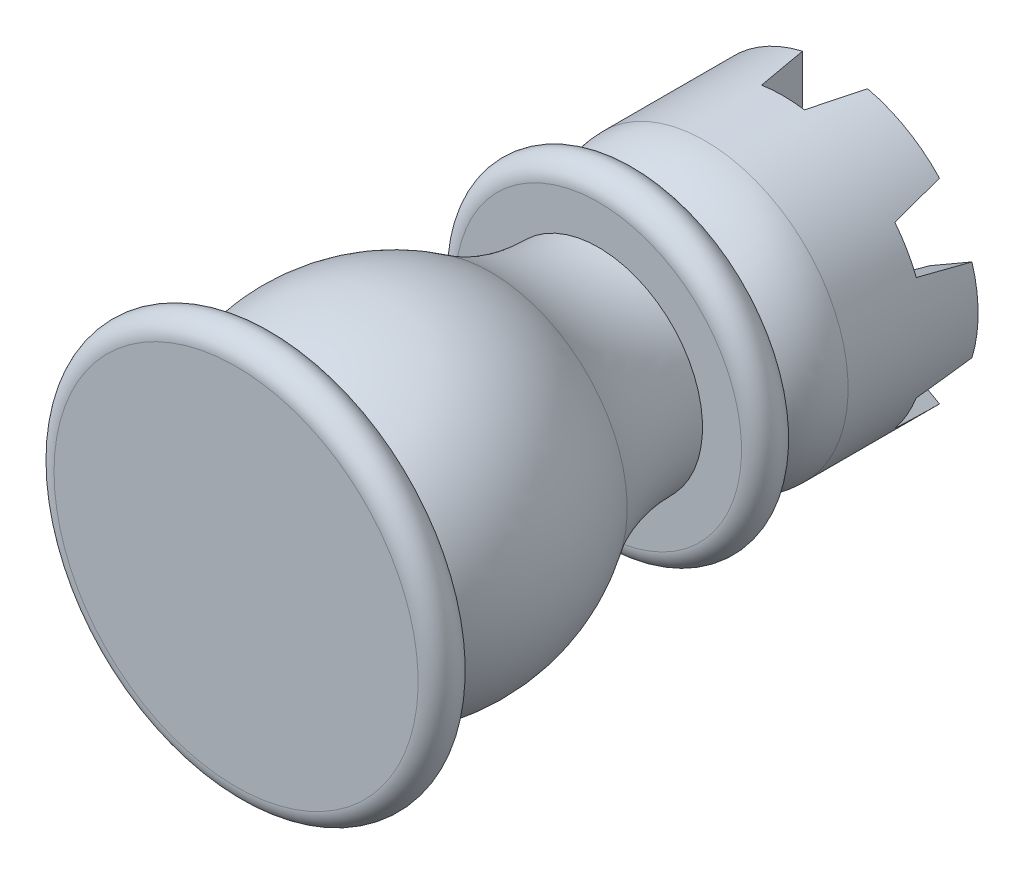
ISO-10303-21;
HEADER;
FILE_DESCRIPTION(('STEP AP214'),'2;1');
FILE_NAME('part.step','',(''),(''),'','','');
FILE_SCHEMA(('AUTOMOTIVE_DESIGN { 1 0 10303 214 1 1 1 1 }'));
ENDSEC;
DATA;
#1=APPLICATION_CONTEXT('core data for automotive mechanical design processes');
#2=APPLICATION_PROTOCOL_DEFINITION('international standard','automotive_design',2000,#1);
#3=PRODUCT_CONTEXT('',#1,'mechanical');
#4=PRODUCT('Part','Part','',(#3));
#5=PRODUCT_RELATED_PRODUCT_CATEGORY('part','',(#4));
#6=PRODUCT_DEFINITION_FORMATION('','',#4);
#7=PRODUCT_DEFINITION_CONTEXT('part definition',#1,'design');
#8=PRODUCT_DEFINITION('design','',#6,#7);
#9=PRODUCT_DEFINITION_SHAPE('','',#8);
#10=(LENGTH_UNIT() NAMED_UNIT(*) SI_UNIT(.MILLI.,.METRE.));
#11=(NAMED_UNIT(*) PLANE_ANGLE_UNIT() SI_UNIT($,.RADIAN.));
#12=(NAMED_UNIT(*) SI_UNIT($,.STERADIAN.) SOLID_ANGLE_UNIT());
#13=UNCERTAINTY_MEASURE_WITH_UNIT(LENGTH_MEASURE(1.E-05),#10,'distance_accuracy_value','');
#14=(GEOMETRIC_REPRESENTATION_CONTEXT(3) GLOBAL_UNCERTAINTY_ASSIGNED_CONTEXT((#13)) GLOBAL_UNIT_ASSIGNED_CONTEXT((#10,
#11,#12)) REPRESENTATION_CONTEXT('',''));
#15=CARTESIAN_POINT('',(0.,0.,0.));
#16=DIRECTION('',(0.,0.,1.));
#17=DIRECTION('',(1.,0.,0.));
#18=AXIS2_PLACEMENT_3D('',#15,#16,#17);
#19=CARTESIAN_POINT('',(-1.64977375331991,-15.5,-40.5708383503721));
#20=DIRECTION('',(0.,0.,1.));
#21=DIRECTION('',(1.,0.,0.));
#22=AXIS2_PLACEMENT_3D('',#19,#20,#21);
#23=PLANE('',#22);
#24=CARTESIAN_POINT('',(0.,0.,-40.5708383503721));
#25=DIRECTION('',(0.,0.,1.));
#26=DIRECTION('',(1.,0.,0.));
#27=AXIS2_PLACEMENT_3D('',#24,#25,#26);
#28=CIRCLE('',#27,6.70530792283383);
#29=CARTESIAN_POINT('',(6.45334587332645,-1.82084633597637,-40.5708383503721));
#30=VERTEX_POINT('',#29);
#31=CARTESIAN_POINT('',(4.8035721200065,-4.67833829772003,-40.5708383503721));
#32=VERTEX_POINT('',#31);
#33=EDGE_CURVE('E473',#30,#32,#28,.F.);
#34=ORIENTED_EDGE('',*,*,#33,.F.);
#35=DIRECTION('',(0.866025403784436,-0.500000000000004,0.));
#36=VECTOR('',#35,1.);
#37=CARTESIAN_POINT('',(-17.5118100026694,12.0154428602013,-40.5708383503721));
#38=LINE('',#37,#36);
#39=CARTESIAN_POINT('',(10.2434156854571,-4.0090441622575,-40.5708383503721));
#40=VERTEX_POINT('',#39);
#41=EDGE_CURVE('E265',#30,#40,#38,.T.);
#42=ORIENTED_EDGE('',*,*,#41,.T.);
#43=CARTESIAN_POINT('',(0.,0.,-40.5708383503721));
#44=DIRECTION('',(0.,0.,1.));
#45=DIRECTION('',(1.,0.,0.));
#46=AXIS2_PLACEMENT_3D('',#43,#44,#45);
#47=CIRCLE('',#46,11.);
#48=CARTESIAN_POINT('',(8.59364193213719,-6.86653612400118,-40.5708383503721));
#49=VERTEX_POINT('',#48);
#50=EDGE_CURVE('E282',#40,#49,#47,.F.);
#51=ORIENTED_EDGE('',*,*,#50,.T.);
#52=DIRECTION('',(0.866025403784436,-0.500000000000004,0.));
#53=VECTOR('',#52,1.);
#54=CARTESIAN_POINT('',(-19.1615837559893,9.15795089845766,-40.5708383503721));
#55=LINE('',#54,#53);
#56=EDGE_CURVE('E260',#32,#49,#55,.T.);
#57=ORIENTED_EDGE('',*,*,#56,.F.);
#58=EDGE_LOOP('',(#34,#42,#51,#57));
#59=FACE_BOUND('',#58,.T.);
#60=ADVANCED_FACE('F47',(#59),#23,.F.);
#61=CARTESIAN_POINT('',(1.64977375331991,-6.49918463369636,-40.5708383503721));
#62=VERTEX_POINT('',#61);
#63=CARTESIAN_POINT('',(-1.64977375331991,-6.4991846336964,-40.5708383503721));
#64=VERTEX_POINT('',#63);
#65=EDGE_CURVE('E505',#62,#64,#28,.F.);
#66=ORIENTED_EDGE('',*,*,#65,.F.);
#67=DIRECTION('',(0.,1.,0.));
#68=VECTOR('',#67,1.);
#69=CARTESIAN_POINT('',(1.64977375331991,-15.5,-40.5708383503721));
#70=LINE('',#69,#68);
#71=CARTESIAN_POINT('',(1.64977375331991,-10.8755802862586,-40.5708383503721));
#72=VERTEX_POINT('',#71);
#73=EDGE_CURVE('E292',#72,#62,#70,.T.);
#74=ORIENTED_EDGE('',*,*,#73,.F.);
#75=CARTESIAN_POINT('',(0.,0.,-40.5708383503721));
#76=DIRECTION('',(0.,0.,1.));
#77=DIRECTION('',(1.,0.,0.));
#78=AXIS2_PLACEMENT_3D('',#75,#76,#77);
#79=CIRCLE('',#78,11.);
#80=CARTESIAN_POINT('',(-1.64977375331991,-10.8755802862586,-40.5708383503721));
#81=VERTEX_POINT('',#80);
#82=EDGE_CURVE('E365',#72,#81,#79,.F.);
#83=ORIENTED_EDGE('',*,*,#82,.T.);
#84=DIRECTION('',(0.,1.,0.));
#85=VECTOR('',#84,1.);
#86=CARTESIAN_POINT('',(-1.64977375331991,-15.5,-40.5708383503721));
#87=LINE('',#86,#85);
#88=EDGE_CURVE('E297',#81,#64,#87,.T.);
#89=ORIENTED_EDGE('',*,*,#88,.T.);
#90=EDGE_LOOP('',(#66,#74,#83,#89));
#91=FACE_BOUND('',#90,.T.);
#92=ADVANCED_FACE('F555',(#91),#23,.F.);
#93=CARTESIAN_POINT('',(-4.8035721200066,-4.67833829771998,-40.5708383503721));
#94=VERTEX_POINT('',#93);
#95=CARTESIAN_POINT('',(-6.4533458733265,-1.82084633597629,-40.5708383503721));
#96=VERTEX_POINT('',#95);
#97=EDGE_CURVE('E62',#94,#96,#28,.F.);
#98=ORIENTED_EDGE('',*,*,#97,.F.);
#99=DIRECTION('',(-0.866025403784443,-0.499999999999992,0.));
#100=VECTOR('',#99,1.);
#101=CARTESIAN_POINT('',(19.1615837559894,9.15795089845737,-40.5708383503721));
#102=LINE('',#101,#100);
#103=CARTESIAN_POINT('',(-8.5936419321373,-6.86653612400107,-40.5708383503721));
#104=VERTEX_POINT('',#103);
#105=EDGE_CURVE('E246',#94,#104,#102,.T.);
#106=ORIENTED_EDGE('',*,*,#105,.T.);
#107=CARTESIAN_POINT('',(-10.2434156854572,-4.00904416225736,-40.5708383503721));
#108=VERTEX_POINT('',#107);
#109=EDGE_CURVE('E283',#104,#108,#47,.F.);
#110=ORIENTED_EDGE('',*,*,#109,.T.);
#111=DIRECTION('',(-0.866025403784443,-0.499999999999992,0.));
#112=VECTOR('',#111,1.);
#113=CARTESIAN_POINT('',(17.5118100026695,12.0154428602011,-40.5708383503721));
#114=LINE('',#113,#112);
#115=EDGE_CURVE('E236',#96,#108,#114,.T.);
#116=ORIENTED_EDGE('',*,*,#115,.F.);
#117=EDGE_LOOP('',(#98,#106,#110,#116));
#118=FACE_BOUND('',#117,.T.);
#119=ADVANCED_FACE('F497',(#118),#23,.F.);
#120=CARTESIAN_POINT('',(-6.45334587332645,1.82084633597636,-40.5708383503721));
#121=VERTEX_POINT('',#120);
#122=CARTESIAN_POINT('',(-4.80357212000653,4.67833829772004,-40.5708383503721));
#123=VERTEX_POINT('',#122);
#124=EDGE_CURVE('E379',#121,#123,#28,.F.);
#125=ORIENTED_EDGE('',*,*,#124,.F.);
#126=CARTESIAN_POINT('',(-10.2434156854571,4.0090441622575,-40.5708383503721));
#127=VERTEX_POINT('',#126);
#128=EDGE_CURVE('E256',#127,#121,#55,.T.);
#129=ORIENTED_EDGE('',*,*,#128,.F.);
#130=CARTESIAN_POINT('',(-8.5936419321372,6.86653612400118,-40.5708383503721));
#131=VERTEX_POINT('',#130);
#132=EDGE_CURVE('E377',#127,#131,#47,.F.);
#133=ORIENTED_EDGE('',*,*,#132,.T.);
#134=EDGE_CURVE('E261',#131,#123,#38,.T.);
#135=ORIENTED_EDGE('',*,*,#134,.T.);
#136=EDGE_LOOP('',(#125,#129,#133,#135));
#137=FACE_BOUND('',#136,.T.);
#138=ADVANCED_FACE('F376',(#137),#23,.F.);
#139=CARTESIAN_POINT('',(-1.64977375331991,6.49918463369639,-40.5708383503721));
#140=VERTEX_POINT('',#139);
#141=CARTESIAN_POINT('',(1.64977375331991,6.49918463369636,-40.5708383503721));
#142=VERTEX_POINT('',#141);
#143=EDGE_CURVE('E456',#140,#142,#28,.F.);
#144=ORIENTED_EDGE('',*,*,#143,.F.);
#145=CARTESIAN_POINT('',(-1.64977375331991,10.8755802862586,-40.5708383503721));
#146=VERTEX_POINT('',#145);
#147=EDGE_CURVE('E291',#140,#146,#87,.T.);
#148=ORIENTED_EDGE('',*,*,#147,.T.);
#149=CARTESIAN_POINT('',(1.64977375331991,10.8755802862586,-40.5708383503721));
#150=VERTEX_POINT('',#149);
#151=EDGE_CURVE('E361',#146,#150,#79,.F.);
#152=ORIENTED_EDGE('',*,*,#151,.T.);
#153=EDGE_CURVE('E296',#142,#150,#70,.T.);
#154=ORIENTED_EDGE('',*,*,#153,.F.);
#155=EDGE_LOOP('',(#144,#148,#152,#154));
#156=FACE_BOUND('',#155,.T.);
#157=ADVANCED_FACE('F453',(#156),#23,.F.);
#158=CARTESIAN_POINT('',(0.,0.,-44.5708383503721));
#159=DIRECTION('',(0.,0.,-1.));
#160=DIRECTION('',(-1.,0.,0.));
#161=AXIS2_PLACEMENT_3D('',#158,#159,#160);
#162=PLANE('',#161);
#163=DIRECTION('',(0.,1.,0.));
#164=VECTOR('',#163,1.);
#165=CARTESIAN_POINT('',(-2.5,0.,-44.5708383503721));
#166=LINE('',#165,#164);
#167=CARTESIAN_POINT('',(-2.5,6.9761900212122,-44.5708383503721));
#168=VERTEX_POINT('',#167);
#169=CARTESIAN_POINT('',(-2.5,10.7121426428143,-44.5708383503721));
#170=VERTEX_POINT('',#169);
#171=EDGE_CURVE('E356',#168,#170,#166,.T.);
#172=ORIENTED_EDGE('',*,*,#171,.F.);
#173=CARTESIAN_POINT('',(0.,0.,-44.5708383503721));
#174=DIRECTION('',(0.,0.,-1.));
#175=DIRECTION('',(-1.,0.,0.));
#176=AXIS2_PLACEMENT_3D('',#173,#174,#175);
#177=CIRCLE('',#176,7.41061584566766);
#178=CARTESIAN_POINT('',(-4.79155777999724,5.65315852006721,-44.5708383503721));
#179=VERTEX_POINT('',#178);
#180=EDGE_CURVE('E514',#168,#179,#177,.F.);
#181=ORIENTED_EDGE('',*,*,#180,.T.);
#182=DIRECTION('',(0.866025403784436,-0.500000000000004,0.));
#183=VECTOR('',#182,1.);
#184=CARTESIAN_POINT('',(-17.0866968793294,12.7517603887906,-44.5708383503721));
#185=LINE('',#184,#183);
#186=CARTESIAN_POINT('',(-8.0269876576397,7.52113483086827,-44.5708383503721));
#187=VERTEX_POINT('',#186);
#188=EDGE_CURVE('E247',#187,#179,#185,.T.);
#189=ORIENTED_EDGE('',*,*,#188,.F.);
#190=CARTESIAN_POINT('',(0.,0.,-44.5708383503721));
#191=DIRECTION('',(0.,0.,-1.));
#192=DIRECTION('',(-1.,0.,0.));
#193=AXIS2_PLACEMENT_3D('',#190,#191,#192);
#194=CIRCLE('',#193,11.);
#195=EDGE_CURVE('E314',#187,#170,#194,.T.);
#196=ORIENTED_EDGE('',*,*,#195,.T.);
#197=EDGE_LOOP('',(#172,#181,#189,#196));
#198=FACE_BOUND('',#197,.T.);
#199=ADVANCED_FACE('F540',(#198),#162,.T.);
#200=DIRECTION('',(0.866025403784436,-0.500000000000004,0.));
#201=VECTOR('',#200,1.);
#202=CARTESIAN_POINT('',(-19.5866968793294,8.42163336986841,-44.5708383503721));
#203=LINE('',#202,#201);
#204=CARTESIAN_POINT('',(-10.5269876576397,3.19100781194609,-44.5708383503721));
#205=VERTEX_POINT('',#204);
#206=CARTESIAN_POINT('',(-7.29155777999726,1.32303150114503,-44.5708383503721));
#207=VERTEX_POINT('',#206);
#208=EDGE_CURVE('E219',#205,#207,#203,.T.);
#209=ORIENTED_EDGE('',*,*,#208,.T.);
#210=CARTESIAN_POINT('',(0.,0.,-44.5708383503721));
#211=DIRECTION('',(0.,0.,-1.));
#212=DIRECTION('',(-1.,0.,0.));
#213=AXIS2_PLACEMENT_3D('',#210,#211,#212);
#214=CIRCLE('',#213,7.41061584566766);
#215=CARTESIAN_POINT('',(-7.2915577799973,-1.32303150114495,-44.5708383503721));
#216=VERTEX_POINT('',#215);
#217=EDGE_CURVE('E208',#207,#216,#214,.F.);
#218=ORIENTED_EDGE('',*,*,#217,.T.);
#219=DIRECTION('',(-0.866025403784443,-0.499999999999992,0.));
#220=VECTOR('',#219,1.);
#221=CARTESIAN_POINT('',(17.0866968793295,12.7517603887903,-44.5708383503721));
#222=LINE('',#221,#220);
#223=CARTESIAN_POINT('',(-10.5269876576398,-3.19100781194595,-44.5708383503721));
#224=VERTEX_POINT('',#223);
#225=EDGE_CURVE('E217',#216,#224,#222,.T.);
#226=ORIENTED_EDGE('',*,*,#225,.T.);
#227=EDGE_CURVE('E313',#224,#205,#194,.T.);
#228=ORIENTED_EDGE('',*,*,#227,.T.);
#229=EDGE_LOOP('',(#209,#218,#226,#228));
#230=FACE_BOUND('',#229,.T.);
#231=ADVANCED_FACE('F215',(#230),#162,.T.);
#232=DIRECTION('',(0.,-1.,0.));
#233=VECTOR('',#232,1.);
#234=CARTESIAN_POINT('',(2.5,0.,-44.5708383503721));
#235=LINE('',#234,#233);
#236=CARTESIAN_POINT('',(2.5,-6.97619002121222,-44.5708383503721));
#237=VERTEX_POINT('',#236);
#238=CARTESIAN_POINT('',(2.5,-10.7121426428143,-44.5708383503721));
#239=VERTEX_POINT('',#238);
#240=EDGE_CURVE('E352',#237,#239,#235,.T.);
#241=ORIENTED_EDGE('',*,*,#240,.F.);
#242=CARTESIAN_POINT('',(0.,0.,-44.5708383503721));
#243=DIRECTION('',(0.,0.,-1.));
#244=DIRECTION('',(-1.,0.,0.));
#245=AXIS2_PLACEMENT_3D('',#242,#243,#244);
#246=CIRCLE('',#245,7.41061584566766);
#247=CARTESIAN_POINT('',(4.79155777999724,-5.65315852006722,-44.5708383503721));
#248=VERTEX_POINT('',#247);
#249=EDGE_CURVE('E524',#237,#248,#246,.F.);
#250=ORIENTED_EDGE('',*,*,#249,.T.);
#251=CARTESIAN_POINT('',(8.0269876576397,-7.52113483086828,-44.5708383503721));
#252=VERTEX_POINT('',#251);
#253=EDGE_CURVE('E255',#248,#252,#203,.T.);
#254=ORIENTED_EDGE('',*,*,#253,.T.);
#255=EDGE_CURVE('E312',#252,#239,#194,.T.);
#256=ORIENTED_EDGE('',*,*,#255,.T.);
#257=EDGE_LOOP('',(#241,#250,#254,#256));
#258=FACE_BOUND('',#257,.T.);
#259=ADVANCED_FACE('F729',(#258),#162,.T.);
#260=CARTESIAN_POINT('',(7.29155777999725,-1.32303150114503,-44.5708383503721));
#261=VERTEX_POINT('',#260);
#262=CARTESIAN_POINT('',(10.5269876576397,-3.19100781194609,-44.5708383503721));
#263=VERTEX_POINT('',#262);
#264=EDGE_CURVE('E252',#261,#263,#185,.T.);
#265=ORIENTED_EDGE('',*,*,#264,.F.);
#266=CARTESIAN_POINT('',(0.,0.,-44.5708383503721));
#267=DIRECTION('',(0.,0.,-1.));
#268=DIRECTION('',(-1.,0.,0.));
#269=AXIS2_PLACEMENT_3D('',#266,#267,#268);
#270=CIRCLE('',#269,7.41061584566766);
#271=CARTESIAN_POINT('',(7.29155777999728,1.32303150114494,-44.5708383503721));
#272=VERTEX_POINT('',#271);
#273=EDGE_CURVE('E489',#261,#272,#270,.F.);
#274=ORIENTED_EDGE('',*,*,#273,.T.);
#275=DIRECTION('',(-0.866025403784443,-0.499999999999992,0.));
#276=VECTOR('',#275,1.);
#277=CARTESIAN_POINT('',(19.5866968793295,8.42163336986812,-44.5708383503721));
#278=LINE('',#277,#276);
#279=CARTESIAN_POINT('',(10.5269876576398,3.19100781194595,-44.5708383503721));
#280=VERTEX_POINT('',#279);
#281=EDGE_CURVE('E239',#280,#272,#278,.T.);
#282=ORIENTED_EDGE('',*,*,#281,.F.);
#283=EDGE_CURVE('E439',#280,#263,#194,.T.);
#284=ORIENTED_EDGE('',*,*,#283,.T.);
#285=EDGE_LOOP('',(#265,#274,#282,#284));
#286=FACE_BOUND('',#285,.T.);
#287=ADVANCED_FACE('F711',(#286),#162,.T.);
#288=CARTESIAN_POINT('',(-1.64977375331991,-15.5,-40.5708383503721));
#289=DIRECTION('',(-0.978147600733806,0.,0.20791169081776));
#290=DIRECTION('',(0.20791169081776,0.,0.978147600733806));
#291=AXIS2_PLACEMENT_3D('',#288,#289,#290);
#292=PLANE('',#291);
#293=CARTESIAN_POINT('',(-14.196649835293,0.,-99.5992493455178));
#294=DIRECTION('',(-0.978147600733806,0.,0.20791169081776));
#295=DIRECTION('',(-0.20791169081776,0.,-0.978147600733805));
#296=AXIS2_PLACEMENT_3D('',#293,#294,#295);
#297=ELLIPSE('',#296,82.3119149400137,9.55671284905579);
#298=EDGE_CURVE('E518',#168,#140,#297,.F.);
#299=ORIENTED_EDGE('',*,*,#298,.F.);
#300=ORIENTED_EDGE('',*,*,#171,.T.);
#301=CARTESIAN_POINT('',(0.,0.,-32.809263076676));
#302=DIRECTION('',(-0.978147600733806,0.,0.20791169081776));
#303=DIRECTION('',(-0.20791169081776,0.,-0.978147600733806));
#304=AXIS2_PLACEMENT_3D('',#301,#302,#303);
#305=ELLIPSE('',#304,52.9070777921854,11.);
#306=EDGE_CURVE('E307',#170,#146,#305,.F.);
#307=ORIENTED_EDGE('',*,*,#306,.T.);
#308=ORIENTED_EDGE('',*,*,#147,.F.);
#309=EDGE_LOOP('',(#299,#300,#307,#308));
#310=FACE_BOUND('',#309,.T.);
#311=ADVANCED_FACE('F460',(#310),#292,.F.);
#312=CARTESIAN_POINT('',(1.64977375331991,-15.5,-40.5708383503721));
#313=DIRECTION('',(0.978147600733806,0.,0.20791169081776));
#314=DIRECTION('',(0.20791169081776,0.,-0.978147600733806));
#315=AXIS2_PLACEMENT_3D('',#312,#313,#314);
#316=PLANE('',#315);
#317=CARTESIAN_POINT('',(14.196649835293,0.,-99.5992493455177));
#318=DIRECTION('',(0.978147600733806,0.,0.20791169081776));
#319=DIRECTION('',(0.20791169081776,0.,-0.978147600733805));
#320=AXIS2_PLACEMENT_3D('',#317,#318,#319);
#321=ELLIPSE('',#320,82.3119149400136,9.55671284905578);
#322=EDGE_CURVE('E513',#237,#62,#321,.F.);
#323=ORIENTED_EDGE('',*,*,#322,.F.);
#324=ORIENTED_EDGE('',*,*,#240,.T.);
#325=CARTESIAN_POINT('',(0.,0.,-32.809263076676));
#326=DIRECTION('',(0.978147600733806,0.,0.20791169081776));
#327=DIRECTION('',(0.20791169081776,0.,-0.978147600733806));
#328=AXIS2_PLACEMENT_3D('',#325,#326,#327);
#329=ELLIPSE('',#328,52.9070777921851,11.);
#330=EDGE_CURVE('E303',#239,#72,#329,.F.);
#331=ORIENTED_EDGE('',*,*,#330,.T.);
#332=ORIENTED_EDGE('',*,*,#73,.T.);
#333=EDGE_LOOP('',(#323,#324,#331,#332));
#334=FACE_BOUND('',#333,.T.);
#335=ADVANCED_FACE('F571',(#334),#316,.F.);
#336=CARTESIAN_POINT('',(-4.79155777999735,-5.65315852006716,-44.5708383503721));
#337=VERTEX_POINT('',#336);
#338=CARTESIAN_POINT('',(-8.02698765763981,-7.52113483086816,-44.5708383503721));
#339=VERTEX_POINT('',#338);
#340=EDGE_CURVE('E234',#337,#339,#278,.T.);
#341=ORIENTED_EDGE('',*,*,#340,.F.);
#342=CARTESIAN_POINT('',(0.,0.,-44.5708383503721));
#343=DIRECTION('',(0.,0.,-1.));
#344=DIRECTION('',(-1.,0.,0.));
#345=AXIS2_PLACEMENT_3D('',#342,#343,#344);
#346=CIRCLE('',#345,7.41061584566766);
#347=CARTESIAN_POINT('',(-2.5,-6.9761900212122,-44.5708383503721));
#348=VERTEX_POINT('',#347);
#349=EDGE_CURVE('E424',#337,#348,#346,.F.);
#350=ORIENTED_EDGE('',*,*,#349,.T.);
#351=CARTESIAN_POINT('',(-2.5,-10.7121426428143,-44.5708383503721));
#352=VERTEX_POINT('',#351);
#353=EDGE_CURVE('E357',#352,#348,#166,.T.);
#354=ORIENTED_EDGE('',*,*,#353,.F.);
#355=EDGE_CURVE('E308',#352,#339,#194,.T.);
#356=ORIENTED_EDGE('',*,*,#355,.T.);
#357=EDGE_LOOP('',(#341,#350,#354,#356));
#358=FACE_BOUND('',#357,.T.);
#359=ADVANCED_FACE('F423',(#358),#162,.T.);
#360=CARTESIAN_POINT('',(0.,0.,1.5));
#361=DIRECTION('',(0.,0.,1.));
#362=DIRECTION('',(1.,0.,0.));
#363=AXIS2_PLACEMENT_3D('',#360,#361,#362);
#364=PLANE('',#363);
#365=CARTESIAN_POINT('',(0.,0.,1.49999999999999));
#366=DIRECTION('',(0.,0.,-1.));
#367=DIRECTION('',(-1.,0.,0.));
#368=AXIS2_PLACEMENT_3D('',#365,#366,#367);
#369=CIRCLE('',#368,14.);
#370=CARTESIAN_POINT('',(-14.,0.,1.5));
#371=VERTEX_POINT('',#370);
#372=EDGE_CURVE('E316',#371,#371,#369,.T.);
#373=ORIENTED_EDGE('',*,*,#372,.F.);
#374=EDGE_LOOP('',(#373));
#375=FACE_BOUND('',#374,.T.);
#376=ADVANCED_FACE('F49',(#375),#364,.T.);
#377=CARTESIAN_POINT('',(0.,0.,-36.5708383503721));
#378=DIRECTION('',(0.,0.,-1.));
#379=DIRECTION('',(-1.,0.,0.));
#380=AXIS2_PLACEMENT_3D('',#377,#378,#379);
#381=CYLINDRICAL_SURFACE('',#380,11.);
#382=CARTESIAN_POINT('',(0.,0.,-32.809263076676));
#383=DIRECTION('',(0.489073800366907,0.847100670886272,0.20791169081776));
#384=DIRECTION('',(0.10395584540888,0.180056805991956,-0.978147600733806));
#385=AXIS2_PLACEMENT_3D('',#382,#383,#384);
#386=ELLIPSE('',#385,52.9070777921852,11.);
#387=EDGE_CURVE('E272',#131,#187,#386,.F.);
#388=ORIENTED_EDGE('',*,*,#387,.F.);
#389=ORIENTED_EDGE('',*,*,#132,.F.);
#390=CARTESIAN_POINT('',(0.,0.,-32.809263076676));
#391=DIRECTION('',(-0.489073800366907,-0.847100670886272,0.20791169081776));
#392=DIRECTION('',(-0.103955845408881,-0.180056805991955,-0.978147600733806));
#393=AXIS2_PLACEMENT_3D('',#390,#391,#392);
#394=ELLIPSE('',#393,52.9070777921854,11.);
#395=EDGE_CURVE('E56',#205,#127,#394,.F.);
#396=ORIENTED_EDGE('',*,*,#395,.F.);
#397=ORIENTED_EDGE('',*,*,#227,.F.);
#398=CARTESIAN_POINT('',(0.,0.,-32.809263076676));
#399=DIRECTION('',(-0.489073800366895,0.847100670886278,0.20791169081776));
#400=DIRECTION('',(-0.103955845408879,0.180056805991956,-0.978147600733805));
#401=AXIS2_PLACEMENT_3D('',#398,#399,#400);
#402=ELLIPSE('',#401,52.9070777921854,11.);
#403=EDGE_CURVE('E225',#108,#224,#402,.F.);
#404=ORIENTED_EDGE('',*,*,#403,.F.);
#405=ORIENTED_EDGE('',*,*,#109,.F.);
#406=CARTESIAN_POINT('',(0.,0.,-32.809263076676));
#407=DIRECTION('',(0.489073800366895,-0.847100670886278,0.20791169081776));
#408=DIRECTION('',(0.103955845408878,-0.180056805991957,-0.978147600733805));
#409=AXIS2_PLACEMENT_3D('',#406,#407,#408);
#410=ELLIPSE('',#409,52.9070777921852,11.);
#411=EDGE_CURVE('E268',#339,#104,#410,.F.);
#412=ORIENTED_EDGE('',*,*,#411,.F.);
#413=ORIENTED_EDGE('',*,*,#355,.F.);
#414=EDGE_CURVE('E304',#81,#352,#305,.F.);
#415=ORIENTED_EDGE('',*,*,#414,.F.);
#416=ORIENTED_EDGE('',*,*,#82,.F.);
#417=ORIENTED_EDGE('',*,*,#330,.F.);
#418=ORIENTED_EDGE('',*,*,#255,.F.);
#419=CARTESIAN_POINT('',(0.,0.,-32.809263076676));
#420=DIRECTION('',(-0.489073800366907,-0.847100670886272,0.20791169081776));
#421=DIRECTION('',(-0.103955845408881,-0.180056805991955,-0.978147600733806));
#422=AXIS2_PLACEMENT_3D('',#419,#420,#421);
#423=ELLIPSE('',#422,52.9070777921854,11.);
#424=EDGE_CURVE('E275',#49,#252,#423,.F.);
#425=ORIENTED_EDGE('',*,*,#424,.F.);
#426=ORIENTED_EDGE('',*,*,#50,.F.);
#427=CARTESIAN_POINT('',(0.,0.,-32.809263076676));
#428=DIRECTION('',(0.489073800366907,0.847100670886272,0.20791169081776));
#429=DIRECTION('',(0.10395584540888,0.180056805991956,-0.978147600733806));
#430=AXIS2_PLACEMENT_3D('',#427,#428,#429);
#431=ELLIPSE('',#430,52.9070777921852,11.);
#432=EDGE_CURVE('E287',#263,#40,#431,.F.);
#433=ORIENTED_EDGE('',*,*,#432,.F.);
#434=ORIENTED_EDGE('',*,*,#283,.F.);
#435=CARTESIAN_POINT('',(0.,0.,-32.809263076676));
#436=DIRECTION('',(0.489073800366895,-0.847100670886278,0.20791169081776));
#437=DIRECTION('',(0.103955845408878,-0.180056805991957,-0.978147600733805));
#438=AXIS2_PLACEMENT_3D('',#435,#436,#437);
#439=ELLIPSE('',#438,52.9070777921852,11.);
#440=CARTESIAN_POINT('',(10.2434156854572,4.00904416225736,-40.5708383503721));
#441=VERTEX_POINT('',#440);
#442=EDGE_CURVE('E284',#441,#280,#439,.F.);
#443=ORIENTED_EDGE('',*,*,#442,.F.);
#444=CARTESIAN_POINT('',(8.59364193213728,6.86653612400106,-40.5708383503721));
#445=VERTEX_POINT('',#444);
#446=EDGE_CURVE('E279',#445,#441,#47,.F.);
#447=ORIENTED_EDGE('',*,*,#446,.F.);
#448=CARTESIAN_POINT('',(0.,0.,-32.809263076676));
#449=DIRECTION('',(-0.489073800366895,0.847100670886278,0.20791169081776));
#450=DIRECTION('',(-0.103955845408879,0.180056805991956,-0.978147600733805));
#451=AXIS2_PLACEMENT_3D('',#448,#449,#450);
#452=ELLIPSE('',#451,52.9070777921854,11.);
#453=CARTESIAN_POINT('',(8.02698765763981,7.52113483086817,-44.5708383503721));
#454=VERTEX_POINT('',#453);
#455=EDGE_CURVE('E251',#454,#445,#452,.F.);
#456=ORIENTED_EDGE('',*,*,#455,.F.);
#457=CARTESIAN_POINT('',(2.5,10.7121426428143,-44.5708383503721));
#458=VERTEX_POINT('',#457);
#459=EDGE_CURVE('E315',#458,#454,#194,.T.);
#460=ORIENTED_EDGE('',*,*,#459,.F.);
#461=EDGE_CURVE('E70',#150,#458,#329,.F.);
#462=ORIENTED_EDGE('',*,*,#461,.F.);
#463=ORIENTED_EDGE('',*,*,#151,.F.);
#464=ORIENTED_EDGE('',*,*,#306,.F.);
#465=ORIENTED_EDGE('',*,*,#195,.F.);
#466=EDGE_LOOP('',(#388,#389,#396,#397,#404,#405,#412,#413,#415,#416,#417,#418,#425,#426,#433,
#434,#443,#447,#456,#460,#462,#463,#464,#465));
#467=FACE_BOUND('',#466,.T.);
#468=CARTESIAN_POINT('',(0.,0.,-34.5708383503721));
#469=DIRECTION('',(0.,0.,-1.));
#470=DIRECTION('',(-1.,0.,0.));
#471=AXIS2_PLACEMENT_3D('',#468,#469,#470);
#472=CIRCLE('',#471,11.);
#473=CARTESIAN_POINT('',(-11.,0.,-34.5708383503721));
#474=VERTEX_POINT('',#473);
#475=EDGE_CURVE('E348',#474,#474,#472,.T.);
#476=ORIENTED_EDGE('',*,*,#475,.T.);
#477=EDGE_LOOP('',(#476));
#478=FACE_BOUND('',#477,.T.);
#479=ADVANCED_FACE('F381',(#467,#478),#381,.T.);
#480=CARTESIAN_POINT('',(0.,0.,-34.5708383503721));
#481=DIRECTION('',(0.,0.,-1.));
#482=DIRECTION('',(-1.,0.,0.));
#483=AXIS2_PLACEMENT_3D('',#480,#481,#482);
#484=DEGENERATE_TOROIDAL_SURFACE('',#483,4.99999999999999,6.,.T.);
#485=CARTESIAN_POINT('',(0.,0.,-29.3746859276655));
#486=DIRECTION('',(0.,0.,-1.));
#487=DIRECTION('',(-1.,0.,0.));
#488=AXIS2_PLACEMENT_3D('',#485,#486,#487);
#489=CIRCLE('',#488,8.00000000000001);
#490=CARTESIAN_POINT('',(-8.00000000000001,0.,-29.3746859276655));
#491=VERTEX_POINT('',#490);
#492=EDGE_CURVE('E344',#491,#491,#489,.T.);
#493=ORIENTED_EDGE('',*,*,#492,.T.);
#494=EDGE_LOOP('',(#493));
#495=FACE_BOUND('',#494,.T.);
#496=ORIENTED_EDGE('',*,*,#475,.F.);
#497=EDGE_LOOP('',(#496));
#498=FACE_BOUND('',#497,.T.);
#499=ADVANCED_FACE('F605',(#495,#498),#484,.T.);
#500=CARTESIAN_POINT('',(0.,0.,-29.3746859276655));
#501=DIRECTION('',(0.,0.,1.));
#502=DIRECTION('',(1.,0.,0.));
#503=AXIS2_PLACEMENT_3D('',#500,#501,#502);
#504=PLANE('',#503);
#505=ORIENTED_EDGE('',*,*,#492,.F.);
#506=EDGE_LOOP('',(#505));
#507=FACE_BOUND('',#506,.T.);
#508=CARTESIAN_POINT('',(0.,0.,-29.3746859276655));
#509=DIRECTION('',(0.,0.,-1.));
#510=DIRECTION('',(-1.,0.,0.));
#511=AXIS2_PLACEMENT_3D('',#508,#509,#510);
#512=CIRCLE('',#511,11.);
#513=CARTESIAN_POINT('',(-11.,0.,-29.3746859276655));
#514=VERTEX_POINT('',#513);
#515=EDGE_CURVE('E340',#514,#514,#512,.T.);
#516=ORIENTED_EDGE('',*,*,#515,.T.);
#517=EDGE_LOOP('',(#516));
#518=FACE_BOUND('',#517,.T.);
#519=ADVANCED_FACE('F674',(#507,#518),#504,.F.);
#520=CARTESIAN_POINT('',(0.,0.,-27.8746859276655));
#521=DIRECTION('',(0.,0.,-1.));
#522=DIRECTION('',(-1.,0.,0.));
#523=AXIS2_PLACEMENT_3D('',#520,#521,#522);
#524=TOROIDAL_SURFACE('',#523,11.,1.49999999999999);
#525=CARTESIAN_POINT('',(0.,0.,-26.3746859276655));
#526=DIRECTION('',(0.,0.,-1.));
#527=DIRECTION('',(-1.,0.,0.));
#528=AXIS2_PLACEMENT_3D('',#525,#526,#527);
#529=CIRCLE('',#528,11.);
#530=CARTESIAN_POINT('',(-11.,0.,-26.3746859276655));
#531=VERTEX_POINT('',#530);
#532=EDGE_CURVE('E336',#531,#531,#529,.T.);
#533=ORIENTED_EDGE('',*,*,#532,.T.);
#534=EDGE_LOOP('',(#533));
#535=FACE_BOUND('',#534,.T.);
#536=ORIENTED_EDGE('',*,*,#515,.F.);
#537=EDGE_LOOP('',(#536));
#538=FACE_BOUND('',#537,.T.);
#539=ADVANCED_FACE('F663',(#535,#538),#524,.T.);
#540=CARTESIAN_POINT('',(0.,0.,-26.3746859276655));
#541=DIRECTION('',(0.,0.,1.));
#542=DIRECTION('',(1.,0.,0.));
#543=AXIS2_PLACEMENT_3D('',#540,#541,#542);
#544=PLANE('',#543);
#545=CARTESIAN_POINT('',(0.,0.,-26.3746859276655));
#546=DIRECTION('',(0.,0.,-1.));
#547=DIRECTION('',(-1.,0.,0.));
#548=AXIS2_PLACEMENT_3D('',#545,#546,#547);
#549=CIRCLE('',#548,8.00000000000001);
#550=CARTESIAN_POINT('',(-8.00000000000001,0.,-26.3746859276655));
#551=VERTEX_POINT('',#550);
#552=EDGE_CURVE('E332',#551,#551,#549,.T.);
#553=ORIENTED_EDGE('',*,*,#552,.T.);
#554=EDGE_LOOP('',(#553));
#555=FACE_BOUND('',#554,.T.);
#556=ORIENTED_EDGE('',*,*,#532,.F.);
#557=EDGE_LOOP('',(#556));
#558=FACE_BOUND('',#557,.T.);
#559=ADVANCED_FACE('F652',(#555,#558),#544,.T.);
#560=CARTESIAN_POINT('',(0.,0.,-26.3746859276655));
#561=DIRECTION('',(0.,0.,-1.));
#562=DIRECTION('',(-1.,0.,0.));
#563=AXIS2_PLACEMENT_3D('',#560,#561,#562);
#564=TOROIDAL_SURFACE('',#563,23.,15.);
#565=ORIENTED_EDGE('',*,*,#552,.F.);
#566=EDGE_LOOP('',(#565));
#567=FACE_BOUND('',#566,.T.);
#568=CARTESIAN_POINT('',(0.,0.,-18.083123951777));
#569=DIRECTION('',(0.,0.,-1.));
#570=DIRECTION('',(-1.,0.,0.));
#571=AXIS2_PLACEMENT_3D('',#568,#569,#570);
#572=CIRCLE('',#571,10.5);
#573=CARTESIAN_POINT('',(-10.5,0.,-18.083123951777));
#574=VERTEX_POINT('',#573);
#575=EDGE_CURVE('E328',#574,#574,#572,.T.);
#576=ORIENTED_EDGE('',*,*,#575,.T.);
#577=EDGE_LOOP('',(#576));
#578=FACE_BOUND('',#577,.T.);
#579=ADVANCED_FACE('F641',(#567,#578),#564,.F.);
#580=CARTESIAN_POINT('',(0.,0.,-9.7915619758885));
#581=DIRECTION('',(0.,0.,-1.));
#582=DIRECTION('',(-1.,0.,0.));
#583=AXIS2_PLACEMENT_3D('',#580,#581,#582);
#584=DEGENERATE_TOROIDAL_SURFACE('',#583,1.99999999999999,15.,.F.);
#585=CARTESIAN_POINT('',(0.,0.,-1.50000000000001));
#586=DIRECTION('',(0.,0.,-1.));
#587=DIRECTION('',(-1.,0.,0.));
#588=AXIS2_PLACEMENT_3D('',#585,#586,#587);
#589=CIRCLE('',#588,10.5);
#590=CARTESIAN_POINT('',(-10.5,0.,-1.5));
#591=VERTEX_POINT('',#590);
#592=EDGE_CURVE('E324',#591,#591,#589,.T.);
#593=ORIENTED_EDGE('',*,*,#592,.T.);
#594=EDGE_LOOP('',(#593));
#595=FACE_BOUND('',#594,.T.);
#596=ORIENTED_EDGE('',*,*,#575,.F.);
#597=EDGE_LOOP('',(#596));
#598=FACE_BOUND('',#597,.T.);
#599=ADVANCED_FACE('F630',(#595,#598),#584,.F.);
#600=CARTESIAN_POINT('',(0.,0.,-1.50000000000001));
#601=DIRECTION('',(0.,0.,1.));
#602=DIRECTION('',(1.,0.,0.));
#603=AXIS2_PLACEMENT_3D('',#600,#601,#602);
#604=PLANE('',#603);
#605=ORIENTED_EDGE('',*,*,#592,.F.);
#606=EDGE_LOOP('',(#605));
#607=FACE_BOUND('',#606,.T.);
#608=CARTESIAN_POINT('',(0.,0.,-1.50000000000001));
#609=DIRECTION('',(0.,0.,-1.));
#610=DIRECTION('',(-1.,0.,0.));
#611=AXIS2_PLACEMENT_3D('',#608,#609,#610);
#612=CIRCLE('',#611,14.);
#613=CARTESIAN_POINT('',(-14.,0.,-1.5));
#614=VERTEX_POINT('',#613);
#615=EDGE_CURVE('E320',#614,#614,#612,.T.);
#616=ORIENTED_EDGE('',*,*,#615,.T.);
#617=EDGE_LOOP('',(#616));
#618=FACE_BOUND('',#617,.T.);
#619=ADVANCED_FACE('F618',(#607,#618),#604,.F.);
#620=CARTESIAN_POINT('',(0.,0.,0.));
#621=DIRECTION('',(0.,0.,-1.));
#622=DIRECTION('',(-1.,0.,0.));
#623=AXIS2_PLACEMENT_3D('',#620,#621,#622);
#624=TOROIDAL_SURFACE('',#623,14.,1.5);
#625=ORIENTED_EDGE('',*,*,#372,.T.);
#626=EDGE_LOOP('',(#625));
#627=FACE_BOUND('',#626,.T.);
#628=ORIENTED_EDGE('',*,*,#615,.F.);
#629=EDGE_LOOP('',(#628));
#630=FACE_BOUND('',#629,.T.);
#631=ADVANCED_FACE('F614',(#627,#630),#624,.T.);
#632=CARTESIAN_POINT('',(4.79155777999732,5.65315852006715,-44.5708383503721));
#633=VERTEX_POINT('',#632);
#634=EDGE_CURVE('E228',#454,#633,#222,.T.);
#635=ORIENTED_EDGE('',*,*,#634,.T.);
#636=CARTESIAN_POINT('',(0.,0.,-44.5708383503721));
#637=DIRECTION('',(0.,0.,-1.));
#638=DIRECTION('',(-1.,0.,0.));
#639=AXIS2_PLACEMENT_3D('',#636,#637,#638);
#640=CIRCLE('',#639,7.41061584566766);
#641=CARTESIAN_POINT('',(2.5,6.97619002121222,-44.5708383503721));
#642=VERTEX_POINT('',#641);
#643=EDGE_CURVE('E468',#633,#642,#640,.F.);
#644=ORIENTED_EDGE('',*,*,#643,.T.);
#645=EDGE_CURVE('E353',#458,#642,#235,.T.);
#646=ORIENTED_EDGE('',*,*,#645,.F.);
#647=ORIENTED_EDGE('',*,*,#459,.T.);
#648=EDGE_LOOP('',(#635,#644,#646,#647));
#649=FACE_BOUND('',#648,.T.);
#650=ADVANCED_FACE('F466',(#649),#162,.T.);
#651=CARTESIAN_POINT('',(-14.196649835293,0.,-99.5992493455178));
#652=DIRECTION('',(-0.978147600733806,0.,0.20791169081776));
#653=DIRECTION('',(-0.20791169081776,0.,-0.978147600733805));
#654=AXIS2_PLACEMENT_3D('',#651,#652,#653);
#655=ELLIPSE('',#654,82.3119149400137,9.55671284905579);
#656=EDGE_CURVE('E429',#64,#348,#655,.F.);
#657=ORIENTED_EDGE('',*,*,#656,.F.);
#658=ORIENTED_EDGE('',*,*,#88,.F.);
#659=ORIENTED_EDGE('',*,*,#414,.T.);
#660=ORIENTED_EDGE('',*,*,#353,.T.);
#661=EDGE_LOOP('',(#657,#658,#659,#660));
#662=FACE_BOUND('',#661,.T.);
#663=ADVANCED_FACE('F427',(#662),#292,.F.);
#664=CARTESIAN_POINT('',(14.196649835293,0.,-99.5992493455177));
#665=DIRECTION('',(0.978147600733806,0.,0.20791169081776));
#666=DIRECTION('',(0.20791169081776,0.,-0.978147600733805));
#667=AXIS2_PLACEMENT_3D('',#664,#665,#666);
#668=ELLIPSE('',#667,82.3119149400136,9.55671284905578);
#669=EDGE_CURVE('E471',#142,#642,#668,.F.);
#670=ORIENTED_EDGE('',*,*,#669,.F.);
#671=ORIENTED_EDGE('',*,*,#153,.T.);
#672=ORIENTED_EDGE('',*,*,#461,.T.);
#673=ORIENTED_EDGE('',*,*,#645,.T.);
#674=EDGE_LOOP('',(#670,#671,#672,#673));
#675=FACE_BOUND('',#674,.T.);
#676=ADVANCED_FACE('F470',(#675),#316,.F.);
#677=CARTESIAN_POINT('',(4.80357212000663,4.67833829772,-40.5708383503721));
#678=VERTEX_POINT('',#677);
#679=CARTESIAN_POINT('',(6.45334587332648,1.82084633597628,-40.5708383503721));
#680=VERTEX_POINT('',#679);
#681=EDGE_CURVE('E480',#678,#680,#28,.F.);
#682=ORIENTED_EDGE('',*,*,#681,.F.);
#683=EDGE_CURVE('E229',#445,#678,#114,.T.);
#684=ORIENTED_EDGE('',*,*,#683,.F.);
#685=ORIENTED_EDGE('',*,*,#446,.T.);
#686=EDGE_CURVE('E242',#441,#680,#102,.T.);
#687=ORIENTED_EDGE('',*,*,#686,.T.);
#688=EDGE_LOOP('',(#682,#684,#685,#687));
#689=FACE_BOUND('',#688,.T.);
#690=ADVANCED_FACE('F557',(#689),#23,.F.);
#691=CARTESIAN_POINT('',(17.5118100026695,12.0154428602011,-40.5708383503721));
#692=DIRECTION('',(-0.489073800366895,0.847100670886278,0.20791169081776));
#693=DIRECTION('',(-0.866025403784443,-0.499999999999992,0.));
#694=AXIS2_PLACEMENT_3D('',#691,#692,#693);
#695=PLANE('',#694);
#696=CARTESIAN_POINT('',(-7.0983249176464,12.294659405996,-99.5992493455178));
#697=DIRECTION('',(-0.489073800366895,0.847100670886278,0.20791169081776));
#698=DIRECTION('',(-0.103955845408878,0.180056805991957,-0.978147600733806));
#699=AXIS2_PLACEMENT_3D('',#696,#697,#698);
#700=ELLIPSE('',#699,82.3119149400137,9.55671284905579);
#701=EDGE_CURVE('E486',#633,#678,#700,.F.);
#702=ORIENTED_EDGE('',*,*,#701,.F.);
#703=ORIENTED_EDGE('',*,*,#634,.F.);
#704=ORIENTED_EDGE('',*,*,#455,.T.);
#705=ORIENTED_EDGE('',*,*,#683,.T.);
#706=EDGE_LOOP('',(#702,#703,#704,#705));
#707=FACE_BOUND('',#706,.T.);
#708=ADVANCED_FACE('F563',(#707),#695,.F.);
#709=CARTESIAN_POINT('',(-19.1615837559893,9.15795089845766,-40.5708383503721));
#710=DIRECTION('',(-0.489073800366907,-0.847100670886272,0.20791169081776));
#711=DIRECTION('',(0.866025403784436,-0.500000000000004,0.));
#712=AXIS2_PLACEMENT_3D('',#709,#710,#711);
#713=PLANE('',#712);
#714=CARTESIAN_POINT('',(-7.09832491764645,-12.2946594059957,-99.5992493455166));
#715=DIRECTION('',(-0.489073800366907,-0.847100670886272,0.20791169081776));
#716=DIRECTION('',(-0.103955845408881,-0.180056805991955,-0.978147600733806));
#717=AXIS2_PLACEMENT_3D('',#714,#715,#716);
#718=ELLIPSE('',#717,82.3119149400122,9.5567128490557);
#719=EDGE_CURVE('E403',#32,#248,#718,.F.);
#720=ORIENTED_EDGE('',*,*,#719,.F.);
#721=ORIENTED_EDGE('',*,*,#56,.T.);
#722=ORIENTED_EDGE('',*,*,#424,.T.);
#723=ORIENTED_EDGE('',*,*,#253,.F.);
#724=EDGE_LOOP('',(#720,#721,#722,#723));
#725=FACE_BOUND('',#724,.T.);
#726=ADVANCED_FACE('F402',(#725),#713,.F.);
#727=CARTESIAN_POINT('',(19.1615837559894,9.15795089845737,-40.5708383503721));
#728=DIRECTION('',(0.489073800366895,-0.847100670886278,0.20791169081776));
#729=DIRECTION('',(0.866025403784443,0.499999999999992,0.));
#730=AXIS2_PLACEMENT_3D('',#727,#728,#729);
#731=PLANE('',#730);
#732=CARTESIAN_POINT('',(7.0983249176464,-12.294659405996,-99.5992493455178));
#733=DIRECTION('',(0.489073800366895,-0.847100670886278,0.20791169081776));
#734=DIRECTION('',(0.103955845408878,-0.180056805991957,-0.978147600733806));
#735=AXIS2_PLACEMENT_3D('',#732,#733,#734);
#736=ELLIPSE('',#735,82.3119149400137,9.55671284905579);
#737=EDGE_CURVE('E492',#680,#272,#736,.F.);
#738=ORIENTED_EDGE('',*,*,#737,.F.);
#739=ORIENTED_EDGE('',*,*,#686,.F.);
#740=ORIENTED_EDGE('',*,*,#442,.T.);
#741=ORIENTED_EDGE('',*,*,#281,.T.);
#742=EDGE_LOOP('',(#738,#739,#740,#741));
#743=FACE_BOUND('',#742,.T.);
#744=ADVANCED_FACE('F550',(#743),#731,.F.);
#745=CARTESIAN_POINT('',(-17.5118100026694,12.0154428602013,-40.5708383503721));
#746=DIRECTION('',(0.489073800366907,0.847100670886272,0.20791169081776));
#747=DIRECTION('',(-0.866025403784436,0.500000000000004,0.));
#748=AXIS2_PLACEMENT_3D('',#745,#746,#747);
#749=PLANE('',#748);
#750=CARTESIAN_POINT('',(7.09832491764646,12.2946594059957,-99.5992493455167));
#751=DIRECTION('',(0.489073800366907,0.847100670886272,0.20791169081776));
#752=DIRECTION('',(0.103955845408881,0.180056805991955,-0.978147600733806));
#753=AXIS2_PLACEMENT_3D('',#750,#751,#752);
#754=ELLIPSE('',#753,82.3119149400123,9.55671284905572);
#755=EDGE_CURVE('E477',#261,#30,#754,.F.);
#756=ORIENTED_EDGE('',*,*,#755,.F.);
#757=ORIENTED_EDGE('',*,*,#264,.T.);
#758=ORIENTED_EDGE('',*,*,#432,.T.);
#759=ORIENTED_EDGE('',*,*,#41,.F.);
#760=EDGE_LOOP('',(#756,#757,#758,#759));
#761=FACE_BOUND('',#760,.T.);
#762=ADVANCED_FACE('F543',(#761),#749,.F.);
#763=CARTESIAN_POINT('',(7.09832491764646,12.2946594059957,-99.5992493455167));
#764=DIRECTION('',(0.489073800366907,0.847100670886272,0.20791169081776));
#765=DIRECTION('',(0.103955845408881,0.180056805991955,-0.978147600733806));
#766=AXIS2_PLACEMENT_3D('',#763,#764,#765);
#767=ELLIPSE('',#766,82.3119149400123,9.55671284905572);
#768=EDGE_CURVE('E509',#123,#179,#767,.F.);
#769=ORIENTED_EDGE('',*,*,#768,.F.);
#770=ORIENTED_EDGE('',*,*,#134,.F.);
#771=ORIENTED_EDGE('',*,*,#387,.T.);
#772=ORIENTED_EDGE('',*,*,#188,.T.);
#773=EDGE_LOOP('',(#769,#770,#771,#772));
#774=FACE_BOUND('',#773,.T.);
#775=ADVANCED_FACE('F541',(#774),#749,.F.);
#776=CARTESIAN_POINT('',(7.0983249176464,-12.294659405996,-99.5992493455178));
#777=DIRECTION('',(0.489073800366895,-0.847100670886278,0.20791169081776));
#778=DIRECTION('',(0.103955845408878,-0.180056805991957,-0.978147600733806));
#779=AXIS2_PLACEMENT_3D('',#776,#777,#778);
#780=ELLIPSE('',#779,82.3119149400137,9.55671284905579);
#781=EDGE_CURVE('E417',#337,#94,#780,.F.);
#782=ORIENTED_EDGE('',*,*,#781,.F.);
#783=ORIENTED_EDGE('',*,*,#340,.T.);
#784=ORIENTED_EDGE('',*,*,#411,.T.);
#785=ORIENTED_EDGE('',*,*,#105,.F.);
#786=EDGE_LOOP('',(#782,#783,#784,#785));
#787=FACE_BOUND('',#786,.T.);
#788=ADVANCED_FACE('F414',(#787),#731,.F.);
#789=CARTESIAN_POINT('',(-7.09832491764645,-12.2946594059957,-99.5992493455166));
#790=DIRECTION('',(-0.489073800366907,-0.847100670886272,0.20791169081776));
#791=DIRECTION('',(-0.103955845408881,-0.180056805991955,-0.978147600733806));
#792=AXIS2_PLACEMENT_3D('',#789,#790,#791);
#793=ELLIPSE('',#792,82.3119149400122,9.5567128490557);
#794=EDGE_CURVE('E221',#207,#121,#793,.F.);
#795=ORIENTED_EDGE('',*,*,#794,.F.);
#796=ORIENTED_EDGE('',*,*,#208,.F.);
#797=ORIENTED_EDGE('',*,*,#395,.T.);
#798=ORIENTED_EDGE('',*,*,#128,.T.);
#799=EDGE_LOOP('',(#795,#796,#797,#798));
#800=FACE_BOUND('',#799,.T.);
#801=ADVANCED_FACE('F371',(#800),#713,.F.);
#802=CARTESIAN_POINT('',(-7.0983249176464,12.294659405996,-99.5992493455178));
#803=DIRECTION('',(-0.489073800366895,0.847100670886278,0.20791169081776));
#804=DIRECTION('',(-0.103955845408878,0.180056805991957,-0.978147600733806));
#805=AXIS2_PLACEMENT_3D('',#802,#803,#804);
#806=ELLIPSE('',#805,82.3119149400137,9.55671284905579);
#807=EDGE_CURVE('E11',#96,#216,#806,.F.);
#808=ORIENTED_EDGE('',*,*,#807,.F.);
#809=ORIENTED_EDGE('',*,*,#115,.T.);
#810=ORIENTED_EDGE('',*,*,#403,.T.);
#811=ORIENTED_EDGE('',*,*,#225,.F.);
#812=EDGE_LOOP('',(#808,#809,#810,#811));
#813=FACE_BOUND('',#812,.T.);
#814=ADVANCED_FACE('F223',(#813),#695,.F.);
#815=CARTESIAN_POINT('',(0.,0.,-36.5708383503721));
#816=DIRECTION('',(0.,0.,-1.));
#817=DIRECTION('',(-1.,0.,0.));
#818=AXIS2_PLACEMENT_3D('',#815,#816,#817);
#819=CONICAL_SURFACE('',#818,6.,0.174532925199426);
#820=CARTESIAN_POINT('',(0.,0.,-36.5708383503721));
#821=DIRECTION('',(0.,0.,-1.));
#822=DIRECTION('',(-1.,0.,0.));
#823=AXIS2_PLACEMENT_3D('',#820,#821,#822);
#824=CIRCLE('',#823,6.);
#825=CARTESIAN_POINT('',(-6.,0.,-36.5708383503721));
#826=VERTEX_POINT('',#825);
#827=EDGE_CURVE('E499',#826,#826,#824,.T.);
#828=ORIENTED_EDGE('',*,*,#827,.F.);
#829=EDGE_LOOP('',(#828));
#830=FACE_BOUND('',#829,.T.);
#831=ORIENTED_EDGE('',*,*,#737,.T.);
#832=ORIENTED_EDGE('',*,*,#273,.F.);
#833=ORIENTED_EDGE('',*,*,#755,.T.);
#834=ORIENTED_EDGE('',*,*,#33,.T.);
#835=ORIENTED_EDGE('',*,*,#719,.T.);
#836=ORIENTED_EDGE('',*,*,#249,.F.);
#837=ORIENTED_EDGE('',*,*,#322,.T.);
#838=ORIENTED_EDGE('',*,*,#65,.T.);
#839=ORIENTED_EDGE('',*,*,#656,.T.);
#840=ORIENTED_EDGE('',*,*,#349,.F.);
#841=ORIENTED_EDGE('',*,*,#781,.T.);
#842=ORIENTED_EDGE('',*,*,#97,.T.);
#843=ORIENTED_EDGE('',*,*,#807,.T.);
#844=ORIENTED_EDGE('',*,*,#217,.F.);
#845=ORIENTED_EDGE('',*,*,#794,.T.);
#846=ORIENTED_EDGE('',*,*,#124,.T.);
#847=ORIENTED_EDGE('',*,*,#768,.T.);
#848=ORIENTED_EDGE('',*,*,#180,.F.);
#849=ORIENTED_EDGE('',*,*,#298,.T.);
#850=ORIENTED_EDGE('',*,*,#143,.T.);
#851=ORIENTED_EDGE('',*,*,#669,.T.);
#852=ORIENTED_EDGE('',*,*,#643,.F.);
#853=ORIENTED_EDGE('',*,*,#701,.T.);
#854=ORIENTED_EDGE('',*,*,#681,.T.);
#855=EDGE_LOOP('',(#831,#832,#833,#834,#835,#836,#837,#838,#839,#840,#841,#842,#843,#844,#845,
#846,#847,#848,#849,#850,#851,#852,#853,#854));
#856=FACE_BOUND('',#855,.T.);
#857=ADVANCED_FACE('F207',(#830,#856),#819,.F.);
#858=CARTESIAN_POINT('',(0.,0.,-36.5708383503721));
#859=DIRECTION('',(0.,0.,-1.));
#860=DIRECTION('',(-1.,0.,0.));
#861=AXIS2_PLACEMENT_3D('',#858,#859,#860);
#862=PLANE('',#861);
#863=ORIENTED_EDGE('',*,*,#827,.T.);
#864=EDGE_LOOP('',(#863));
#865=FACE_BOUND('',#864,.T.);
#866=ADVANCED_FACE('F936',(#865),#862,.T.);
#867=CLOSED_SHELL('',(#60,#92,#119,#138,#157,#199,#231,#259,#287,#311,#335,#359,#376,#479,#499,
#519,#539,#559,#579,#599,#619,#631,#650,#663,#676,#690,#708,#726,#744,#762,#775,#788,#801,#814,
#857,#866));
#868=MANIFOLD_SOLID_BREP('B2',#867);
#869=ADVANCED_BREP_SHAPE_REPRESENTATION('',(#18,#868),#14);
#870=SHAPE_DEFINITION_REPRESENTATION(#9,#869);
ENDSEC;
END-ISO-10303-21;
